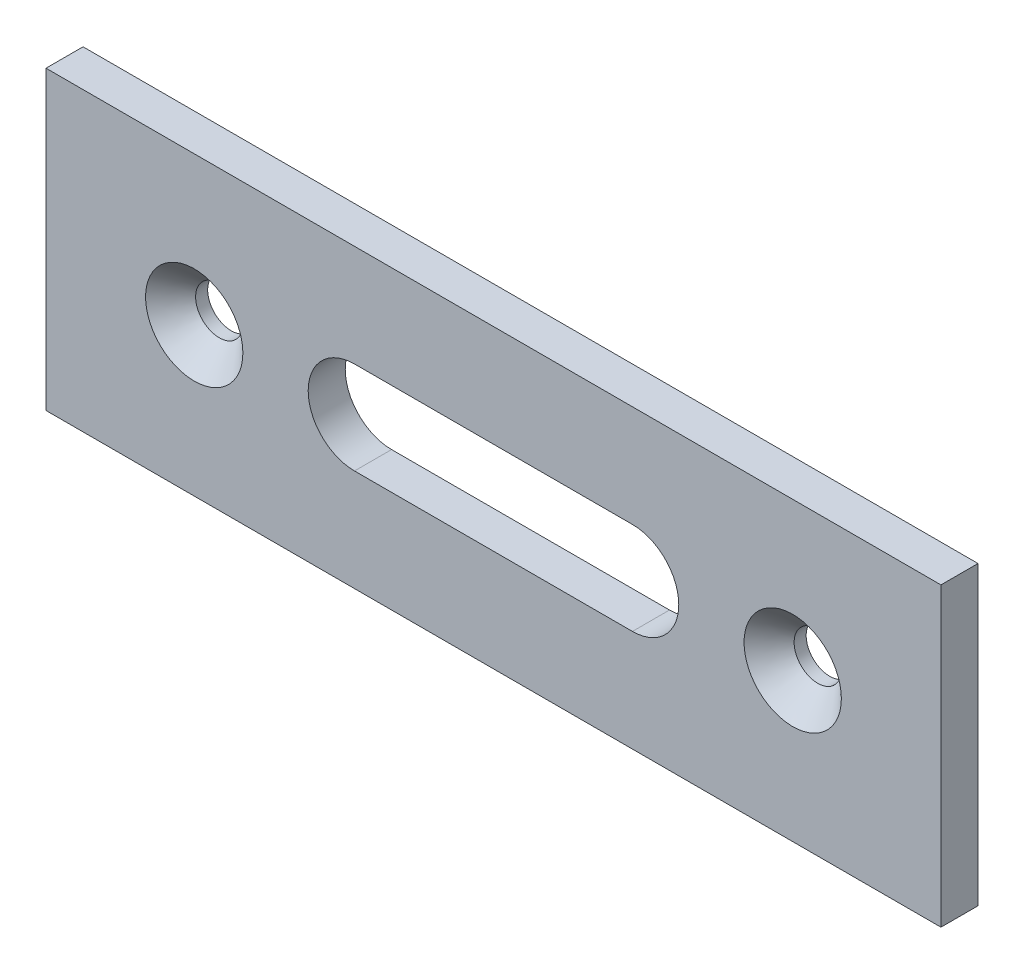
ISO-10303-21;
HEADER;
FILE_DESCRIPTION(('STEP AP214'),'2;1');
FILE_NAME('part.step','',(''),(''),'','','');
FILE_SCHEMA(('AUTOMOTIVE_DESIGN { 1 0 10303 214 1 1 1 1 }'));
ENDSEC;
DATA;
#1=APPLICATION_CONTEXT('core data for automotive mechanical design processes');
#2=APPLICATION_PROTOCOL_DEFINITION('international standard','automotive_design',2000,#1);
#3=PRODUCT_CONTEXT('',#1,'mechanical');
#4=PRODUCT('Part','Part','',(#3));
#5=PRODUCT_RELATED_PRODUCT_CATEGORY('part','',(#4));
#6=PRODUCT_DEFINITION_FORMATION('','',#4);
#7=PRODUCT_DEFINITION_CONTEXT('part definition',#1,'design');
#8=PRODUCT_DEFINITION('design','',#6,#7);
#9=PRODUCT_DEFINITION_SHAPE('','',#8);
#10=(LENGTH_UNIT() NAMED_UNIT(*) SI_UNIT(.MILLI.,.METRE.));
#11=(NAMED_UNIT(*) PLANE_ANGLE_UNIT() SI_UNIT($,.RADIAN.));
#12=(NAMED_UNIT(*) SI_UNIT($,.STERADIAN.) SOLID_ANGLE_UNIT());
#13=UNCERTAINTY_MEASURE_WITH_UNIT(LENGTH_MEASURE(1.E-05),#10,'distance_accuracy_value','');
#14=(GEOMETRIC_REPRESENTATION_CONTEXT(3) GLOBAL_UNCERTAINTY_ASSIGNED_CONTEXT((#13)) GLOBAL_UNIT_ASSIGNED_CONTEXT((#10,
#11,#12)) REPRESENTATION_CONTEXT('',''));
#15=CARTESIAN_POINT('',(0.,0.,0.));
#16=DIRECTION('',(0.,0.,1.));
#17=DIRECTION('',(1.,0.,0.));
#18=AXIS2_PLACEMENT_3D('',#15,#16,#17);
#19=CARTESIAN_POINT('',(-19.8824614450658,16.6713286713287,4.));
#20=DIRECTION('',(1.,0.,0.));
#21=DIRECTION('',(0.,0.,-1.));
#22=AXIS2_PLACEMENT_3D('',#19,#20,#21);
#23=PLANE('',#22);
#24=DIRECTION('',(0.,-1.,0.));
#25=VECTOR('',#24,1.);
#26=CARTESIAN_POINT('',(-19.8824614450658,16.6713286713287,0.));
#27=LINE('',#26,#25);
#28=CARTESIAN_POINT('',(-19.8824614450658,16.6713286713287,0.));
#29=VERTEX_POINT('',#28);
#30=CARTESIAN_POINT('',(-19.8824614450658,-15.3286713286713,0.));
#31=VERTEX_POINT('',#30);
#32=EDGE_CURVE('E150',#29,#31,#27,.T.);
#33=ORIENTED_EDGE('',*,*,#32,.T.);
#34=DIRECTION('',(0.,0.,-1.));
#35=VECTOR('',#34,1.);
#36=CARTESIAN_POINT('',(-19.8824614450658,-15.3286713286713,4.));
#37=LINE('',#36,#35);
#38=CARTESIAN_POINT('',(-19.8824614450658,-15.3286713286713,4.));
#39=VERTEX_POINT('',#38);
#40=EDGE_CURVE('E11',#39,#31,#37,.T.);
#41=ORIENTED_EDGE('',*,*,#40,.F.);
#42=DIRECTION('',(0.,-1.,0.));
#43=VECTOR('',#42,1.);
#44=CARTESIAN_POINT('',(-19.8824614450658,16.6713286713287,4.));
#45=LINE('',#44,#43);
#46=CARTESIAN_POINT('',(-19.8824614450658,16.6713286713287,4.));
#47=VERTEX_POINT('',#46);
#48=EDGE_CURVE('E156',#47,#39,#45,.T.);
#49=ORIENTED_EDGE('',*,*,#48,.F.);
#50=DIRECTION('',(0.,0.,-1.));
#51=VECTOR('',#50,1.);
#52=CARTESIAN_POINT('',(-19.8824614450658,16.6713286713287,4.));
#53=LINE('',#52,#51);
#54=EDGE_CURVE('E170',#47,#29,#53,.T.);
#55=ORIENTED_EDGE('',*,*,#54,.T.);
#56=EDGE_LOOP('',(#33,#41,#49,#55));
#57=FACE_BOUND('',#56,.T.);
#58=ADVANCED_FACE('F39',(#57),#23,.F.);
#59=CARTESIAN_POINT('',(-19.8824614450658,-15.3286713286713,4.));
#60=DIRECTION('',(0.,1.,0.));
#61=DIRECTION('',(-1.,0.,0.));
#62=AXIS2_PLACEMENT_3D('',#59,#60,#61);
#63=PLANE('',#62);
#64=DIRECTION('',(1.,0.,0.));
#65=VECTOR('',#64,1.);
#66=CARTESIAN_POINT('',(-19.8824614450658,-15.3286713286713,0.));
#67=LINE('',#66,#65);
#68=CARTESIAN_POINT('',(76.7175385549342,-15.3286713286713,0.));
#69=VERTEX_POINT('',#68);
#70=EDGE_CURVE('E174',#31,#69,#67,.T.);
#71=ORIENTED_EDGE('',*,*,#70,.T.);
#72=DIRECTION('',(0.,0.,-1.));
#73=VECTOR('',#72,1.);
#74=CARTESIAN_POINT('',(76.7175385549342,-15.3286713286713,4.));
#75=LINE('',#74,#73);
#76=CARTESIAN_POINT('',(76.7175385549342,-15.3286713286713,4.));
#77=VERTEX_POINT('',#76);
#78=EDGE_CURVE('E47',#77,#69,#75,.T.);
#79=ORIENTED_EDGE('',*,*,#78,.F.);
#80=DIRECTION('',(1.,0.,0.));
#81=VECTOR('',#80,1.);
#82=CARTESIAN_POINT('',(-19.8824614450658,-15.3286713286713,4.));
#83=LINE('',#82,#81);
#84=EDGE_CURVE('E160',#39,#77,#83,.T.);
#85=ORIENTED_EDGE('',*,*,#84,.F.);
#86=ORIENTED_EDGE('',*,*,#40,.T.);
#87=EDGE_LOOP('',(#71,#79,#85,#86));
#88=FACE_BOUND('',#87,.T.);
#89=ADVANCED_FACE('F208',(#88),#63,.F.);
#90=CARTESIAN_POINT('',(76.7175385549342,16.6713286713287,4.));
#91=DIRECTION('',(-1.,0.,0.));
#92=DIRECTION('',(0.,0.,1.));
#93=AXIS2_PLACEMENT_3D('',#90,#91,#92);
#94=PLANE('',#93);
#95=DIRECTION('',(0.,1.,0.));
#96=VECTOR('',#95,1.);
#97=CARTESIAN_POINT('',(76.7175385549342,16.6713286713287,0.));
#98=LINE('',#97,#96);
#99=CARTESIAN_POINT('',(76.7175385549342,16.6713286713287,0.));
#100=VERTEX_POINT('',#99);
#101=EDGE_CURVE('E177',#69,#100,#98,.T.);
#102=ORIENTED_EDGE('',*,*,#101,.T.);
#103=DIRECTION('',(0.,0.,-1.));
#104=VECTOR('',#103,1.);
#105=CARTESIAN_POINT('',(76.7175385549342,16.6713286713287,4.));
#106=LINE('',#105,#104);
#107=CARTESIAN_POINT('',(76.7175385549342,16.6713286713287,4.));
#108=VERTEX_POINT('',#107);
#109=EDGE_CURVE('E185',#108,#100,#106,.T.);
#110=ORIENTED_EDGE('',*,*,#109,.F.);
#111=DIRECTION('',(0.,1.,0.));
#112=VECTOR('',#111,1.);
#113=CARTESIAN_POINT('',(76.7175385549342,16.6713286713287,4.));
#114=LINE('',#113,#112);
#115=EDGE_CURVE('E164',#77,#108,#114,.T.);
#116=ORIENTED_EDGE('',*,*,#115,.F.);
#117=ORIENTED_EDGE('',*,*,#78,.T.);
#118=EDGE_LOOP('',(#102,#110,#116,#117));
#119=FACE_BOUND('',#118,.T.);
#120=ADVANCED_FACE('F194',(#119),#94,.F.);
#121=CARTESIAN_POINT('',(-19.8824614450658,16.6713286713287,4.));
#122=DIRECTION('',(0.,-1.,0.));
#123=DIRECTION('',(0.,0.,-1.));
#124=AXIS2_PLACEMENT_3D('',#121,#122,#123);
#125=PLANE('',#124);
#126=DIRECTION('',(-1.,0.,0.));
#127=VECTOR('',#126,1.);
#128=CARTESIAN_POINT('',(-19.8824614450658,16.6713286713287,0.));
#129=LINE('',#128,#127);
#130=EDGE_CURVE('E161',#100,#29,#129,.T.);
#131=ORIENTED_EDGE('',*,*,#130,.T.);
#132=ORIENTED_EDGE('',*,*,#54,.F.);
#133=DIRECTION('',(-1.,0.,0.));
#134=VECTOR('',#133,1.);
#135=CARTESIAN_POINT('',(-19.8824614450658,16.6713286713287,4.));
#136=LINE('',#135,#134);
#137=EDGE_CURVE('E167',#108,#47,#136,.T.);
#138=ORIENTED_EDGE('',*,*,#137,.F.);
#139=ORIENTED_EDGE('',*,*,#109,.T.);
#140=EDGE_LOOP('',(#131,#132,#138,#139));
#141=FACE_BOUND('',#140,.T.);
#142=ADVANCED_FACE('F201',(#141),#125,.F.);
#143=CARTESIAN_POINT('',(0.,0.,4.));
#144=DIRECTION('',(0.,0.,1.));
#145=DIRECTION('',(1.,0.,0.));
#146=AXIS2_PLACEMENT_3D('',#143,#144,#145);
#147=PLANE('',#146);
#148=CARTESIAN_POINT('',(-3.88246144506579,0.671328671328672,4.));
#149=DIRECTION('',(0.,0.,1.));
#150=DIRECTION('',(1.,0.,0.));
#151=AXIS2_PLACEMENT_3D('',#148,#149,#150);
#152=CIRCLE('',#151,5.250000041);
#153=CARTESIAN_POINT('',(1.36753859593421,0.671328671328672,4.));
#154=VERTEX_POINT('',#153);
#155=EDGE_CURVE('E258',#154,#154,#152,.T.);
#156=ORIENTED_EDGE('',*,*,#155,.F.);
#157=EDGE_LOOP('',(#156));
#158=FACE_BOUND('',#157,.T.);
#159=CARTESIAN_POINT('',(60.7175385549342,0.671328671328672,4.));
#160=DIRECTION('',(0.,0.,1.));
#161=DIRECTION('',(1.,0.,0.));
#162=AXIS2_PLACEMENT_3D('',#159,#160,#161);
#163=CIRCLE('',#162,5.250000041);
#164=CARTESIAN_POINT('',(65.9675385959342,0.671328671328672,4.));
#165=VERTEX_POINT('',#164);
#166=EDGE_CURVE('E268',#165,#165,#163,.T.);
#167=ORIENTED_EDGE('',*,*,#166,.F.);
#168=EDGE_LOOP('',(#167));
#169=FACE_BOUND('',#168,.T.);
#170=CARTESIAN_POINT('',(13.4175385549342,0.671328671328674,4.));
#171=DIRECTION('',(0.,0.,1.));
#172=DIRECTION('',(1.,0.,0.));
#173=AXIS2_PLACEMENT_3D('',#170,#171,#172);
#174=CIRCLE('',#173,5.);
#175=CARTESIAN_POINT('',(13.4175385549342,5.67132867132867,4.));
#176=VERTEX_POINT('',#175);
#177=CARTESIAN_POINT('',(13.4175385549342,-4.32867132867133,4.));
#178=VERTEX_POINT('',#177);
#179=EDGE_CURVE('E54',#176,#178,#174,.T.);
#180=ORIENTED_EDGE('',*,*,#179,.F.);
#181=DIRECTION('',(-1.,0.,0.));
#182=VECTOR('',#181,1.);
#183=CARTESIAN_POINT('',(13.4175385549342,5.67132867132867,4.));
#184=LINE('',#183,#182);
#185=CARTESIAN_POINT('',(43.4175385549342,5.67132867132868,4.));
#186=VERTEX_POINT('',#185);
#187=EDGE_CURVE('E125',#186,#176,#184,.T.);
#188=ORIENTED_EDGE('',*,*,#187,.F.);
#189=CARTESIAN_POINT('',(43.4175385549342,0.671328671328679,4.));
#190=DIRECTION('',(0.,0.,1.));
#191=DIRECTION('',(1.,0.,0.));
#192=AXIS2_PLACEMENT_3D('',#189,#190,#191);
#193=CIRCLE('',#192,5.);
#194=CARTESIAN_POINT('',(43.4175385549342,-4.32867132867132,4.));
#195=VERTEX_POINT('',#194);
#196=EDGE_CURVE('E129',#195,#186,#193,.T.);
#197=ORIENTED_EDGE('',*,*,#196,.F.);
#198=DIRECTION('',(1.,0.,0.));
#199=VECTOR('',#198,1.);
#200=CARTESIAN_POINT('',(13.4175385549342,-4.32867132867133,4.));
#201=LINE('',#200,#199);
#202=EDGE_CURVE('E141',#178,#195,#201,.T.);
#203=ORIENTED_EDGE('',*,*,#202,.F.);
#204=EDGE_LOOP('',(#180,#188,#197,#203));
#205=FACE_BOUND('',#204,.T.);
#206=ORIENTED_EDGE('',*,*,#48,.T.);
#207=ORIENTED_EDGE('',*,*,#84,.T.);
#208=ORIENTED_EDGE('',*,*,#115,.T.);
#209=ORIENTED_EDGE('',*,*,#137,.T.);
#210=EDGE_LOOP('',(#206,#207,#208,#209));
#211=FACE_BOUND('',#210,.T.);
#212=ADVANCED_FACE('F207',(#158,#169,#205,#211),#147,.T.);
#213=CARTESIAN_POINT('',(0.,0.,0.));
#214=DIRECTION('',(0.,0.,1.));
#215=DIRECTION('',(1.,0.,0.));
#216=AXIS2_PLACEMENT_3D('',#213,#214,#215);
#217=PLANE('',#216);
#218=CARTESIAN_POINT('',(-3.88246144506579,0.671328671328672,0.));
#219=DIRECTION('',(0.,0.,1.));
#220=DIRECTION('',(1.,0.,0.));
#221=AXIS2_PLACEMENT_3D('',#218,#219,#220);
#222=CIRCLE('',#221,2.54999998);
#223=CARTESIAN_POINT('',(-1.33246146506579,0.671328671328672,0.));
#224=VERTEX_POINT('',#223);
#225=EDGE_CURVE('E262',#224,#224,#222,.T.);
#226=ORIENTED_EDGE('',*,*,#225,.T.);
#227=EDGE_LOOP('',(#226));
#228=FACE_BOUND('',#227,.T.);
#229=CARTESIAN_POINT('',(60.7175385549342,0.671328671328672,0.));
#230=DIRECTION('',(0.,0.,1.));
#231=DIRECTION('',(1.,0.,0.));
#232=AXIS2_PLACEMENT_3D('',#229,#230,#231);
#233=CIRCLE('',#232,2.54999998);
#234=CARTESIAN_POINT('',(63.2675385349342,0.671328671328672,0.));
#235=VERTEX_POINT('',#234);
#236=EDGE_CURVE('E132',#235,#235,#233,.T.);
#237=ORIENTED_EDGE('',*,*,#236,.T.);
#238=EDGE_LOOP('',(#237));
#239=FACE_BOUND('',#238,.T.);
#240=DIRECTION('',(-1.,0.,0.));
#241=VECTOR('',#240,1.);
#242=CARTESIAN_POINT('',(13.4175385549342,5.67132867132867,0.));
#243=LINE('',#242,#241);
#244=CARTESIAN_POINT('',(43.4175385549342,5.67132867132868,0.));
#245=VERTEX_POINT('',#244);
#246=CARTESIAN_POINT('',(13.4175385549342,5.67132867132867,0.));
#247=VERTEX_POINT('',#246);
#248=EDGE_CURVE('E113',#245,#247,#243,.T.);
#249=ORIENTED_EDGE('',*,*,#248,.T.);
#250=CARTESIAN_POINT('',(13.4175385549342,0.671328671328674,0.));
#251=DIRECTION('',(0.,0.,1.));
#252=DIRECTION('',(1.,0.,0.));
#253=AXIS2_PLACEMENT_3D('',#250,#251,#252);
#254=CIRCLE('',#253,5.);
#255=CARTESIAN_POINT('',(13.4175385549342,-4.32867132867133,0.));
#256=VERTEX_POINT('',#255);
#257=EDGE_CURVE('E106',#247,#256,#254,.T.);
#258=ORIENTED_EDGE('',*,*,#257,.T.);
#259=DIRECTION('',(1.,0.,0.));
#260=VECTOR('',#259,1.);
#261=CARTESIAN_POINT('',(13.4175385549342,-4.32867132867133,0.));
#262=LINE('',#261,#260);
#263=CARTESIAN_POINT('',(43.4175385549342,-4.32867132867132,0.));
#264=VERTEX_POINT('',#263);
#265=EDGE_CURVE('E116',#256,#264,#262,.T.);
#266=ORIENTED_EDGE('',*,*,#265,.T.);
#267=CARTESIAN_POINT('',(43.4175385549342,0.671328671328679,0.));
#268=DIRECTION('',(0.,0.,1.));
#269=DIRECTION('',(1.,0.,0.));
#270=AXIS2_PLACEMENT_3D('',#267,#268,#269);
#271=CIRCLE('',#270,5.);
#272=EDGE_CURVE('E62',#264,#245,#271,.T.);
#273=ORIENTED_EDGE('',*,*,#272,.T.);
#274=EDGE_LOOP('',(#249,#258,#266,#273));
#275=FACE_BOUND('',#274,.T.);
#276=ORIENTED_EDGE('',*,*,#32,.F.);
#277=ORIENTED_EDGE('',*,*,#130,.F.);
#278=ORIENTED_EDGE('',*,*,#101,.F.);
#279=ORIENTED_EDGE('',*,*,#70,.F.);
#280=EDGE_LOOP('',(#276,#277,#278,#279));
#281=FACE_BOUND('',#280,.T.);
#282=ADVANCED_FACE('F121',(#228,#239,#275,#281),#217,.F.);
#283=CARTESIAN_POINT('',(13.4175385549342,0.671328671328674,0.));
#284=DIRECTION('',(0.,0.,1.));
#285=DIRECTION('',(1.,0.,0.));
#286=AXIS2_PLACEMENT_3D('',#283,#284,#285);
#287=CYLINDRICAL_SURFACE('',#286,5.);
#288=ORIENTED_EDGE('',*,*,#179,.T.);
#289=DIRECTION('',(0.,0.,1.));
#290=VECTOR('',#289,1.);
#291=CARTESIAN_POINT('',(13.4175385549342,-4.32867132867133,0.));
#292=LINE('',#291,#290);
#293=EDGE_CURVE('E102',#256,#178,#292,.T.);
#294=ORIENTED_EDGE('',*,*,#293,.F.);
#295=ORIENTED_EDGE('',*,*,#257,.F.);
#296=DIRECTION('',(0.,0.,1.));
#297=VECTOR('',#296,1.);
#298=CARTESIAN_POINT('',(13.4175385549342,5.67132867132867,0.));
#299=LINE('',#298,#297);
#300=EDGE_CURVE('E147',#247,#176,#299,.T.);
#301=ORIENTED_EDGE('',*,*,#300,.T.);
#302=EDGE_LOOP('',(#288,#294,#295,#301));
#303=FACE_BOUND('',#302,.T.);
#304=ADVANCED_FACE('F104',(#303),#287,.F.);
#305=CARTESIAN_POINT('',(13.4175385549342,5.67132867132867,0.));
#306=DIRECTION('',(0.,1.,0.));
#307=DIRECTION('',(-1.,0.,0.));
#308=AXIS2_PLACEMENT_3D('',#305,#306,#307);
#309=PLANE('',#308);
#310=ORIENTED_EDGE('',*,*,#187,.T.);
#311=ORIENTED_EDGE('',*,*,#300,.F.);
#312=ORIENTED_EDGE('',*,*,#248,.F.);
#313=DIRECTION('',(0.,0.,1.));
#314=VECTOR('',#313,1.);
#315=CARTESIAN_POINT('',(43.4175385549342,5.67132867132868,0.));
#316=LINE('',#315,#314);
#317=EDGE_CURVE('E151',#245,#186,#316,.T.);
#318=ORIENTED_EDGE('',*,*,#317,.T.);
#319=EDGE_LOOP('',(#310,#311,#312,#318));
#320=FACE_BOUND('',#319,.T.);
#321=ADVANCED_FACE('F226',(#320),#309,.F.);
#322=CARTESIAN_POINT('',(43.4175385549342,0.671328671328679,0.));
#323=DIRECTION('',(0.,0.,1.));
#324=DIRECTION('',(1.,0.,0.));
#325=AXIS2_PLACEMENT_3D('',#322,#323,#324);
#326=CYLINDRICAL_SURFACE('',#325,5.);
#327=ORIENTED_EDGE('',*,*,#196,.T.);
#328=ORIENTED_EDGE('',*,*,#317,.F.);
#329=ORIENTED_EDGE('',*,*,#272,.F.);
#330=DIRECTION('',(0.,0.,1.));
#331=VECTOR('',#330,1.);
#332=CARTESIAN_POINT('',(43.4175385549342,-4.32867132867132,0.));
#333=LINE('',#332,#331);
#334=EDGE_CURVE('E112',#264,#195,#333,.T.);
#335=ORIENTED_EDGE('',*,*,#334,.T.);
#336=EDGE_LOOP('',(#327,#328,#329,#335));
#337=FACE_BOUND('',#336,.T.);
#338=ADVANCED_FACE('F230',(#337),#326,.F.);
#339=CARTESIAN_POINT('',(13.4175385549342,-4.32867132867133,0.));
#340=DIRECTION('',(0.,-1.,0.));
#341=DIRECTION('',(1.,0.,0.));
#342=AXIS2_PLACEMENT_3D('',#339,#340,#341);
#343=PLANE('',#342);
#344=ORIENTED_EDGE('',*,*,#202,.T.);
#345=ORIENTED_EDGE('',*,*,#334,.F.);
#346=ORIENTED_EDGE('',*,*,#265,.F.);
#347=ORIENTED_EDGE('',*,*,#293,.T.);
#348=EDGE_LOOP('',(#344,#345,#346,#347));
#349=FACE_BOUND('',#348,.T.);
#350=ADVANCED_FACE('F117',(#349),#343,.F.);
#351=CARTESIAN_POINT('',(60.7175385549342,0.671328671328672,4.));
#352=DIRECTION('',(0.,0.,1.));
#353=DIRECTION('',(1.,0.,0.));
#354=AXIS2_PLACEMENT_3D('',#351,#352,#353);
#355=CYLINDRICAL_SURFACE('',#354,2.54999998);
#356=ORIENTED_EDGE('',*,*,#236,.F.);
#357=EDGE_LOOP('',(#356));
#358=FACE_BOUND('',#357,.T.);
#359=CARTESIAN_POINT('',(60.7175385549342,0.671328671328672,1.299999939));
#360=DIRECTION('',(0.,0.,1.));
#361=DIRECTION('',(1.,0.,0.));
#362=AXIS2_PLACEMENT_3D('',#359,#360,#361);
#363=CIRCLE('',#362,2.54999998);
#364=CARTESIAN_POINT('',(63.2675385349342,0.671328671328672,1.299999939));
#365=VERTEX_POINT('',#364);
#366=EDGE_CURVE('E271',#365,#365,#363,.T.);
#367=ORIENTED_EDGE('',*,*,#366,.T.);
#368=EDGE_LOOP('',(#367));
#369=FACE_BOUND('',#368,.T.);
#370=ADVANCED_FACE('F229',(#358,#369),#355,.F.);
#371=CARTESIAN_POINT('',(60.7175385549342,0.671328671328672,4.));
#372=DIRECTION('',(0.,0.,1.));
#373=DIRECTION('',(1.,0.,0.));
#374=AXIS2_PLACEMENT_3D('',#371,#372,#373);
#375=CONICAL_SURFACE('',#374,5.250000041,0.785398163397449);
#376=ORIENTED_EDGE('',*,*,#366,.F.);
#377=EDGE_LOOP('',(#376));
#378=FACE_BOUND('',#377,.T.);
#379=ORIENTED_EDGE('',*,*,#166,.T.);
#380=EDGE_LOOP('',(#379));
#381=FACE_BOUND('',#380,.T.);
#382=ADVANCED_FACE('F238',(#378,#381),#375,.F.);
#383=CARTESIAN_POINT('',(-3.88246144506579,0.671328671328672,4.));
#384=DIRECTION('',(0.,0.,1.));
#385=DIRECTION('',(1.,0.,0.));
#386=AXIS2_PLACEMENT_3D('',#383,#384,#385);
#387=CYLINDRICAL_SURFACE('',#386,2.54999998);
#388=ORIENTED_EDGE('',*,*,#225,.F.);
#389=EDGE_LOOP('',(#388));
#390=FACE_BOUND('',#389,.T.);
#391=CARTESIAN_POINT('',(-3.88246144506579,0.671328671328672,1.299999939));
#392=DIRECTION('',(0.,0.,1.));
#393=DIRECTION('',(1.,0.,0.));
#394=AXIS2_PLACEMENT_3D('',#391,#392,#393);
#395=CIRCLE('',#394,2.54999998);
#396=CARTESIAN_POINT('',(-1.33246146506579,0.671328671328672,1.299999939));
#397=VERTEX_POINT('',#396);
#398=EDGE_CURVE('E255',#397,#397,#395,.T.);
#399=ORIENTED_EDGE('',*,*,#398,.T.);
#400=EDGE_LOOP('',(#399));
#401=FACE_BOUND('',#400,.T.);
#402=ADVANCED_FACE('F242',(#390,#401),#387,.F.);
#403=CARTESIAN_POINT('',(-3.88246144506579,0.671328671328672,4.));
#404=DIRECTION('',(0.,0.,1.));
#405=DIRECTION('',(1.,0.,0.));
#406=AXIS2_PLACEMENT_3D('',#403,#404,#405);
#407=CONICAL_SURFACE('',#406,5.250000041,0.785398163397448);
#408=ORIENTED_EDGE('',*,*,#398,.F.);
#409=EDGE_LOOP('',(#408));
#410=FACE_BOUND('',#409,.T.);
#411=ORIENTED_EDGE('',*,*,#155,.T.);
#412=EDGE_LOOP('',(#411));
#413=FACE_BOUND('',#412,.T.);
#414=ADVANCED_FACE('F246',(#410,#413),#407,.F.);
#415=CLOSED_SHELL('',(#58,#89,#120,#142,#212,#282,#304,#321,#338,#350,#370,#382,#402,#414));
#416=MANIFOLD_SOLID_BREP('B2',#415);
#417=ADVANCED_BREP_SHAPE_REPRESENTATION('',(#18,#416),#14);
#418=SHAPE_DEFINITION_REPRESENTATION(#9,#417);
ENDSEC;
END-ISO-10303-21;
